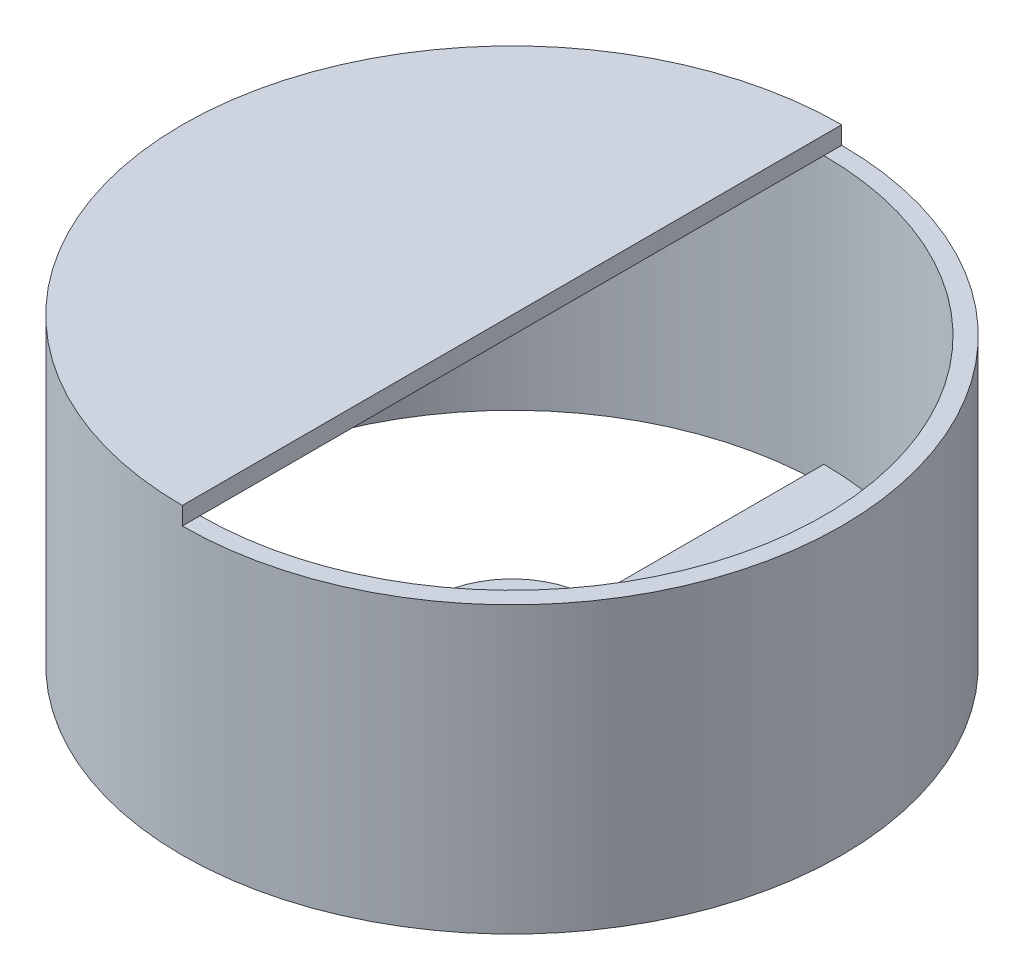
ISO-10303-21;
HEADER;
FILE_DESCRIPTION(('STEP AP214'),'2;1');
FILE_NAME('part.step','',(''),(''),'','','');
FILE_SCHEMA(('AUTOMOTIVE_DESIGN { 1 0 10303 214 1 1 1 1 }'));
ENDSEC;
DATA;
#1=APPLICATION_CONTEXT('core data for automotive mechanical design processes');
#2=APPLICATION_PROTOCOL_DEFINITION('international standard','automotive_design',2000,#1);
#3=PRODUCT_CONTEXT('',#1,'mechanical');
#4=PRODUCT('Part','Part','',(#3));
#5=PRODUCT_RELATED_PRODUCT_CATEGORY('part','',(#4));
#6=PRODUCT_DEFINITION_FORMATION('','',#4);
#7=PRODUCT_DEFINITION_CONTEXT('part definition',#1,'design');
#8=PRODUCT_DEFINITION('design','',#6,#7);
#9=PRODUCT_DEFINITION_SHAPE('','',#8);
#10=(LENGTH_UNIT() NAMED_UNIT(*) SI_UNIT(.MILLI.,.METRE.));
#11=(NAMED_UNIT(*) PLANE_ANGLE_UNIT() SI_UNIT($,.RADIAN.));
#12=(NAMED_UNIT(*) SI_UNIT($,.STERADIAN.) SOLID_ANGLE_UNIT());
#13=UNCERTAINTY_MEASURE_WITH_UNIT(LENGTH_MEASURE(1.E-05),#10,'distance_accuracy_value','');
#14=(GEOMETRIC_REPRESENTATION_CONTEXT(3) GLOBAL_UNCERTAINTY_ASSIGNED_CONTEXT((#13)) GLOBAL_UNIT_ASSIGNED_CONTEXT((#10,
#11,#12)) REPRESENTATION_CONTEXT('',''));
#15=CARTESIAN_POINT('',(0.,0.,0.));
#16=DIRECTION('',(0.,0.,1.));
#17=DIRECTION('',(1.,0.,0.));
#18=AXIS2_PLACEMENT_3D('',#15,#16,#17);
#19=CARTESIAN_POINT('',(0.,1.,0.));
#20=DIRECTION('',(0.,1.,0.));
#21=DIRECTION('',(0.,0.,1.));
#22=AXIS2_PLACEMENT_3D('',#19,#20,#21);
#23=PLANE('',#22);
#24=CARTESIAN_POINT('',(0.,1.,0.));
#25=DIRECTION('',(0.,1.,0.));
#26=DIRECTION('',(0.,0.,1.));
#27=AXIS2_PLACEMENT_3D('',#24,#25,#26);
#28=CIRCLE('',#27,3.5);
#29=CARTESIAN_POINT('',(0.,1.,3.5));
#30=VERTEX_POINT('',#29);
#31=EDGE_CURVE('E150',#30,#30,#28,.T.);
#32=ORIENTED_EDGE('',*,*,#31,.F.);
#33=EDGE_LOOP('',(#32));
#34=FACE_BOUND('',#33,.T.);
#35=DIRECTION('',(0.,0.,1.));
#36=VECTOR('',#35,1.);
#37=CARTESIAN_POINT('',(0.,1.,0.));
#38=LINE('',#37,#36);
#39=CARTESIAN_POINT('',(0.,1.,4.5));
#40=VERTEX_POINT('',#39);
#41=CARTESIAN_POINT('',(0.,1.,17.5));
#42=VERTEX_POINT('',#41);
#43=EDGE_CURVE('E146',#40,#42,#38,.T.);
#44=ORIENTED_EDGE('',*,*,#43,.T.);
#45=CARTESIAN_POINT('',(0.,1.,0.));
#46=DIRECTION('',(0.,1.,0.));
#47=DIRECTION('',(0.,0.,1.));
#48=AXIS2_PLACEMENT_3D('',#45,#46,#47);
#49=CIRCLE('',#48,17.5);
#50=CARTESIAN_POINT('',(0.,1.,-17.5));
#51=VERTEX_POINT('',#50);
#52=EDGE_CURVE('E125',#42,#51,#49,.T.);
#53=ORIENTED_EDGE('',*,*,#52,.T.);
#54=DIRECTION('',(0.,0.,-1.));
#55=VECTOR('',#54,1.);
#56=CARTESIAN_POINT('',(0.,1.,0.));
#57=LINE('',#56,#55);
#58=CARTESIAN_POINT('',(0.,1.,-4.5));
#59=VERTEX_POINT('',#58);
#60=EDGE_CURVE('E138',#59,#51,#57,.T.);
#61=ORIENTED_EDGE('',*,*,#60,.F.);
#62=CARTESIAN_POINT('',(0.,1.,0.));
#63=DIRECTION('',(0.,1.,0.));
#64=DIRECTION('',(0.,0.,1.));
#65=AXIS2_PLACEMENT_3D('',#62,#63,#64);
#66=CIRCLE('',#65,4.5);
#67=EDGE_CURVE('E142',#59,#40,#66,.T.);
#68=ORIENTED_EDGE('',*,*,#67,.T.);
#69=EDGE_LOOP('',(#44,#53,#61,#68));
#70=FACE_BOUND('',#69,.T.);
#71=ADVANCED_FACE('F43',(#34,#70),#23,.T.);
#72=CARTESIAN_POINT('',(0.,1.,0.));
#73=DIRECTION('',(-1.,0.,0.));
#74=DIRECTION('',(0.,0.,1.));
#75=AXIS2_PLACEMENT_3D('',#72,#73,#74);
#76=PLANE('',#75);
#77=DIRECTION('',(0.,0.,-1.));
#78=VECTOR('',#77,1.);
#79=CARTESIAN_POINT('',(0.,0.,0.));
#80=LINE('',#79,#78);
#81=CARTESIAN_POINT('',(0.,0.,-4.5));
#82=VERTEX_POINT('',#81);
#83=CARTESIAN_POINT('',(0.,0.,-17.5));
#84=VERTEX_POINT('',#83);
#85=EDGE_CURVE('E137',#82,#84,#80,.T.);
#86=ORIENTED_EDGE('',*,*,#85,.F.);
#87=DIRECTION('',(0.,-1.,0.));
#88=VECTOR('',#87,1.);
#89=CARTESIAN_POINT('',(0.,1.,-4.5));
#90=LINE('',#89,#88);
#91=EDGE_CURVE('E47',#59,#82,#90,.T.);
#92=ORIENTED_EDGE('',*,*,#91,.F.);
#93=ORIENTED_EDGE('',*,*,#60,.T.);
#94=DIRECTION('',(0.,-1.,0.));
#95=VECTOR('',#94,1.);
#96=CARTESIAN_POINT('',(0.,1.,-17.5));
#97=LINE('',#96,#95);
#98=EDGE_CURVE('E154',#51,#84,#97,.T.);
#99=ORIENTED_EDGE('',*,*,#98,.T.);
#100=EDGE_LOOP('',(#86,#92,#93,#99));
#101=FACE_BOUND('',#100,.T.);
#102=ADVANCED_FACE('F45',(#101),#76,.T.);
#103=CARTESIAN_POINT('',(0.,1.,0.));
#104=DIRECTION('',(0.,-1.,0.));
#105=DIRECTION('',(0.,0.,-1.));
#106=AXIS2_PLACEMENT_3D('',#103,#104,#105);
#107=CYLINDRICAL_SURFACE('',#106,4.5);
#108=CARTESIAN_POINT('',(0.,0.,0.));
#109=DIRECTION('',(0.,1.,0.));
#110=DIRECTION('',(0.,0.,1.));
#111=AXIS2_PLACEMENT_3D('',#108,#109,#110);
#112=CIRCLE('',#111,4.5);
#113=CARTESIAN_POINT('',(0.,0.,4.5));
#114=VERTEX_POINT('',#113);
#115=EDGE_CURVE('E158',#82,#114,#112,.T.);
#116=ORIENTED_EDGE('',*,*,#115,.T.);
#117=DIRECTION('',(0.,-1.,0.));
#118=VECTOR('',#117,1.);
#119=CARTESIAN_POINT('',(0.,1.,4.5));
#120=LINE('',#119,#118);
#121=EDGE_CURVE('E180',#40,#114,#120,.T.);
#122=ORIENTED_EDGE('',*,*,#121,.F.);
#123=ORIENTED_EDGE('',*,*,#67,.F.);
#124=ORIENTED_EDGE('',*,*,#91,.T.);
#125=EDGE_LOOP('',(#116,#122,#123,#124));
#126=FACE_BOUND('',#125,.T.);
#127=ADVANCED_FACE('F191',(#126),#107,.T.);
#128=CARTESIAN_POINT('',(0.,1.,0.));
#129=DIRECTION('',(1.,0.,0.));
#130=DIRECTION('',(0.,0.,-1.));
#131=AXIS2_PLACEMENT_3D('',#128,#129,#130);
#132=PLANE('',#131);
#133=DIRECTION('',(0.,0.,1.));
#134=VECTOR('',#133,1.);
#135=CARTESIAN_POINT('',(0.,0.,0.));
#136=LINE('',#135,#134);
#137=CARTESIAN_POINT('',(0.,0.,17.5));
#138=VERTEX_POINT('',#137);
#139=EDGE_CURVE('E161',#114,#138,#136,.T.);
#140=ORIENTED_EDGE('',*,*,#139,.T.);
#141=DIRECTION('',(0.,-1.,0.));
#142=VECTOR('',#141,1.);
#143=CARTESIAN_POINT('',(0.,1.,17.5));
#144=LINE('',#143,#142);
#145=EDGE_CURVE('E178',#42,#138,#144,.T.);
#146=ORIENTED_EDGE('',*,*,#145,.F.);
#147=ORIENTED_EDGE('',*,*,#43,.F.);
#148=ORIENTED_EDGE('',*,*,#121,.T.);
#149=EDGE_LOOP('',(#140,#146,#147,#148));
#150=FACE_BOUND('',#149,.T.);
#151=ADVANCED_FACE('F203',(#150),#132,.F.);
#152=CARTESIAN_POINT('',(0.,1.,0.));
#153=DIRECTION('',(0.,-1.,0.));
#154=DIRECTION('',(0.,0.,-1.));
#155=AXIS2_PLACEMENT_3D('',#152,#153,#154);
#156=CYLINDRICAL_SURFACE('',#155,18.5);
#157=CARTESIAN_POINT('',(0.,0.,0.));
#158=DIRECTION('',(0.,1.,0.));
#159=DIRECTION('',(0.,0.,1.));
#160=AXIS2_PLACEMENT_3D('',#157,#158,#159);
#161=CIRCLE('',#160,18.5);
#162=CARTESIAN_POINT('',(0.,0.,18.5));
#163=VERTEX_POINT('',#162);
#164=EDGE_CURVE('E169',#163,#163,#161,.T.);
#165=ORIENTED_EDGE('',*,*,#164,.T.);
#166=EDGE_LOOP('',(#165));
#167=FACE_BOUND('',#166,.T.);
#168=CARTESIAN_POINT('',(0.,16.,0.));
#169=DIRECTION('',(0.,1.,0.));
#170=DIRECTION('',(0.,0.,1.));
#171=AXIS2_PLACEMENT_3D('',#168,#169,#170);
#172=CIRCLE('',#171,18.5);
#173=CARTESIAN_POINT('',(0.,16.,18.5));
#174=VERTEX_POINT('',#173);
#175=CARTESIAN_POINT('',(0.,16.,-18.5));
#176=VERTEX_POINT('',#175);
#177=EDGE_CURVE('E123',#174,#176,#172,.T.);
#178=ORIENTED_EDGE('',*,*,#177,.F.);
#179=DIRECTION('',(0.,-1.,0.));
#180=VECTOR('',#179,1.);
#181=CARTESIAN_POINT('',(0.,17.,18.5));
#182=LINE('',#181,#180);
#183=CARTESIAN_POINT('',(0.,17.,18.5));
#184=VERTEX_POINT('',#183);
#185=EDGE_CURVE('E109',#184,#174,#182,.T.);
#186=ORIENTED_EDGE('',*,*,#185,.F.);
#187=CARTESIAN_POINT('',(0.,17.,0.));
#188=DIRECTION('',(0.,1.,0.));
#189=DIRECTION('',(0.,0.,1.));
#190=AXIS2_PLACEMENT_3D('',#187,#188,#189);
#191=CIRCLE('',#190,18.5);
#192=CARTESIAN_POINT('',(0.,17.,-18.5));
#193=VERTEX_POINT('',#192);
#194=EDGE_CURVE('E115',#193,#184,#191,.T.);
#195=ORIENTED_EDGE('',*,*,#194,.F.);
#196=DIRECTION('',(0.,-1.,0.));
#197=VECTOR('',#196,1.);
#198=CARTESIAN_POINT('',(0.,17.,-18.5));
#199=LINE('',#198,#197);
#200=EDGE_CURVE('E111',#193,#176,#199,.T.);
#201=ORIENTED_EDGE('',*,*,#200,.T.);
#202=EDGE_LOOP('',(#178,#186,#195,#201));
#203=FACE_BOUND('',#202,.T.);
#204=ADVANCED_FACE('F122',(#167,#203),#156,.T.);
#205=CARTESIAN_POINT('',(0.,1.,0.));
#206=DIRECTION('',(0.,-1.,0.));
#207=DIRECTION('',(0.,0.,-1.));
#208=AXIS2_PLACEMENT_3D('',#205,#206,#207);
#209=CYLINDRICAL_SURFACE('',#208,17.5);
#210=CARTESIAN_POINT('',(0.,0.,0.));
#211=DIRECTION('',(0.,1.,0.));
#212=DIRECTION('',(0.,0.,1.));
#213=AXIS2_PLACEMENT_3D('',#210,#211,#212);
#214=CIRCLE('',#213,17.5);
#215=EDGE_CURVE('E165',#84,#138,#214,.T.);
#216=ORIENTED_EDGE('',*,*,#215,.F.);
#217=ORIENTED_EDGE('',*,*,#98,.F.);
#218=ORIENTED_EDGE('',*,*,#52,.F.);
#219=ORIENTED_EDGE('',*,*,#145,.T.);
#220=EDGE_LOOP('',(#216,#217,#218,#219));
#221=FACE_BOUND('',#220,.T.);
#222=CARTESIAN_POINT('',(0.,16.,0.));
#223=DIRECTION('',(0.,1.,0.));
#224=DIRECTION('',(0.,0.,1.));
#225=AXIS2_PLACEMENT_3D('',#222,#223,#224);
#226=CIRCLE('',#225,17.5);
#227=CARTESIAN_POINT('',(0.,16.,17.5));
#228=VERTEX_POINT('',#227);
#229=CARTESIAN_POINT('',(0.,16.,-17.5));
#230=VERTEX_POINT('',#229);
#231=EDGE_CURVE('E132',#228,#230,#226,.T.);
#232=ORIENTED_EDGE('',*,*,#231,.T.);
#233=EDGE_CURVE('E66',#230,#228,#226,.T.);
#234=ORIENTED_EDGE('',*,*,#233,.T.);
#235=EDGE_LOOP('',(#232,#234));
#236=FACE_BOUND('',#235,.T.);
#237=ADVANCED_FACE('F201',(#221,#236),#209,.F.);
#238=CARTESIAN_POINT('',(0.,1.,0.));
#239=DIRECTION('',(0.,-1.,0.));
#240=DIRECTION('',(0.,0.,-1.));
#241=AXIS2_PLACEMENT_3D('',#238,#239,#240);
#242=CYLINDRICAL_SURFACE('',#241,3.5);
#243=ORIENTED_EDGE('',*,*,#31,.T.);
#244=EDGE_LOOP('',(#243));
#245=FACE_BOUND('',#244,.T.);
#246=CARTESIAN_POINT('',(0.,0.,0.));
#247=DIRECTION('',(0.,1.,0.));
#248=DIRECTION('',(0.,0.,1.));
#249=AXIS2_PLACEMENT_3D('',#246,#247,#248);
#250=CIRCLE('',#249,3.5);
#251=CARTESIAN_POINT('',(0.,0.,3.5));
#252=VERTEX_POINT('',#251);
#253=EDGE_CURVE('E143',#252,#252,#250,.T.);
#254=ORIENTED_EDGE('',*,*,#253,.F.);
#255=EDGE_LOOP('',(#254));
#256=FACE_BOUND('',#255,.T.);
#257=ADVANCED_FACE('F227',(#245,#256),#242,.F.);
#258=CARTESIAN_POINT('',(0.,0.,0.));
#259=DIRECTION('',(0.,1.,0.));
#260=DIRECTION('',(0.,0.,1.));
#261=AXIS2_PLACEMENT_3D('',#258,#259,#260);
#262=PLANE('',#261);
#263=ORIENTED_EDGE('',*,*,#85,.T.);
#264=ORIENTED_EDGE('',*,*,#215,.T.);
#265=ORIENTED_EDGE('',*,*,#139,.F.);
#266=ORIENTED_EDGE('',*,*,#115,.F.);
#267=EDGE_LOOP('',(#263,#264,#265,#266));
#268=FACE_BOUND('',#267,.T.);
#269=ORIENTED_EDGE('',*,*,#164,.F.);
#270=EDGE_LOOP('',(#269));
#271=FACE_BOUND('',#270,.T.);
#272=ORIENTED_EDGE('',*,*,#253,.T.);
#273=EDGE_LOOP('',(#272));
#274=FACE_BOUND('',#273,.T.);
#275=ADVANCED_FACE('F196',(#268,#271,#274),#262,.F.);
#276=CARTESIAN_POINT('',(0.,16.,0.));
#277=DIRECTION('',(0.,1.,0.));
#278=DIRECTION('',(0.,0.,1.));
#279=AXIS2_PLACEMENT_3D('',#276,#277,#278);
#280=PLANE('',#279);
#281=DIRECTION('',(0.,0.,-1.));
#282=VECTOR('',#281,1.);
#283=CARTESIAN_POINT('',(0.,16.,-18.5));
#284=LINE('',#283,#282);
#285=EDGE_CURVE('E54',#174,#228,#284,.T.);
#286=ORIENTED_EDGE('',*,*,#285,.F.);
#287=ORIENTED_EDGE('',*,*,#177,.T.);
#288=EDGE_CURVE('E11',#230,#176,#284,.T.);
#289=ORIENTED_EDGE('',*,*,#288,.F.);
#290=ORIENTED_EDGE('',*,*,#231,.F.);
#291=EDGE_LOOP('',(#286,#287,#289,#290));
#292=FACE_BOUND('',#291,.T.);
#293=ADVANCED_FACE('F223',(#292),#280,.T.);
#294=CARTESIAN_POINT('',(0.,17.,-18.5));
#295=DIRECTION('',(-1.,0.,0.));
#296=DIRECTION('',(0.,0.,1.));
#297=AXIS2_PLACEMENT_3D('',#294,#295,#296);
#298=PLANE('',#297);
#299=ORIENTED_EDGE('',*,*,#285,.T.);
#300=EDGE_CURVE('E55',#228,#230,#284,.T.);
#301=ORIENTED_EDGE('',*,*,#300,.T.);
#302=ORIENTED_EDGE('',*,*,#288,.T.);
#303=ORIENTED_EDGE('',*,*,#200,.F.);
#304=DIRECTION('',(0.,0.,-1.));
#305=VECTOR('',#304,1.);
#306=CARTESIAN_POINT('',(0.,17.,-18.5));
#307=LINE('',#306,#305);
#308=EDGE_CURVE('E104',#184,#193,#307,.T.);
#309=ORIENTED_EDGE('',*,*,#308,.F.);
#310=ORIENTED_EDGE('',*,*,#185,.T.);
#311=EDGE_LOOP('',(#299,#301,#302,#303,#309,#310));
#312=FACE_BOUND('',#311,.T.);
#313=ADVANCED_FACE('F107',(#312),#298,.F.);
#314=CARTESIAN_POINT('',(0.,17.,0.));
#315=DIRECTION('',(0.,1.,0.));
#316=DIRECTION('',(0.,0.,1.));
#317=AXIS2_PLACEMENT_3D('',#314,#315,#316);
#318=PLANE('',#317);
#319=ORIENTED_EDGE('',*,*,#194,.T.);
#320=ORIENTED_EDGE('',*,*,#308,.T.);
#321=EDGE_LOOP('',(#319,#320));
#322=FACE_BOUND('',#321,.T.);
#323=ADVANCED_FACE('F117',(#322),#318,.T.);
#324=CARTESIAN_POINT('',(0.,16.,0.));
#325=DIRECTION('',(0.,1.,0.));
#326=DIRECTION('',(0.,0.,1.));
#327=AXIS2_PLACEMENT_3D('',#324,#325,#326);
#328=PLANE('',#327);
#329=ORIENTED_EDGE('',*,*,#233,.F.);
#330=ORIENTED_EDGE('',*,*,#300,.F.);
#331=EDGE_LOOP('',(#329,#330));
#332=FACE_BOUND('',#331,.T.);
#333=ADVANCED_FACE('F260',(#332),#328,.F.);
#334=CLOSED_SHELL('',(#71,#102,#127,#151,#204,#237,#257,#275,#293,#313,#323,#333));
#335=MANIFOLD_SOLID_BREP('B2',#334);
#336=ADVANCED_BREP_SHAPE_REPRESENTATION('',(#18,#335),#14);
#337=SHAPE_DEFINITION_REPRESENTATION(#9,#336);
ENDSEC;
END-ISO-10303-21;
